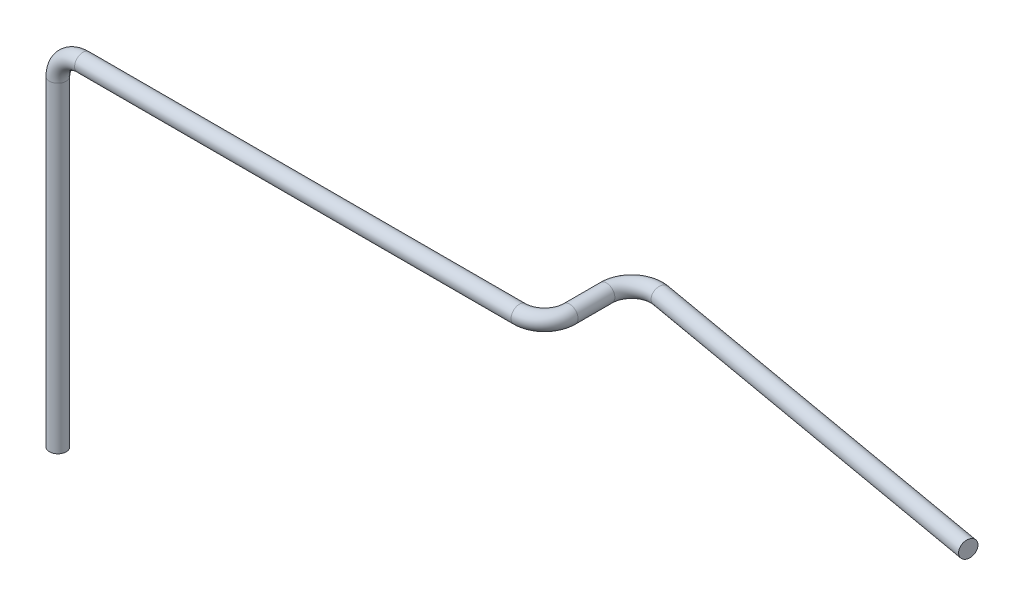
ISO-10303-21;
HEADER;
FILE_DESCRIPTION(('STEP AP214'),'2;1');
FILE_NAME('part.step','',(''),(''),'','','');
FILE_SCHEMA(('AUTOMOTIVE_DESIGN { 1 0 10303 214 1 1 1 1 }'));
ENDSEC;
DATA;
#1=APPLICATION_CONTEXT('core data for automotive mechanical design processes');
#2=APPLICATION_PROTOCOL_DEFINITION('international standard','automotive_design',2000,#1);
#3=PRODUCT_CONTEXT('',#1,'mechanical');
#4=PRODUCT('Part','Part','',(#3));
#5=PRODUCT_RELATED_PRODUCT_CATEGORY('part','',(#4));
#6=PRODUCT_DEFINITION_FORMATION('','',#4);
#7=PRODUCT_DEFINITION_CONTEXT('part definition',#1,'design');
#8=PRODUCT_DEFINITION('design','',#6,#7);
#9=PRODUCT_DEFINITION_SHAPE('','',#8);
#10=(LENGTH_UNIT() NAMED_UNIT(*) SI_UNIT(.MILLI.,.METRE.));
#11=(NAMED_UNIT(*) PLANE_ANGLE_UNIT() SI_UNIT($,.RADIAN.));
#12=(NAMED_UNIT(*) SI_UNIT($,.STERADIAN.) SOLID_ANGLE_UNIT());
#13=UNCERTAINTY_MEASURE_WITH_UNIT(LENGTH_MEASURE(1.E-05),#10,'distance_accuracy_value','');
#14=(GEOMETRIC_REPRESENTATION_CONTEXT(3) GLOBAL_UNCERTAINTY_ASSIGNED_CONTEXT((#13)) GLOBAL_UNIT_ASSIGNED_CONTEXT((#10,
#11,#12)) REPRESENTATION_CONTEXT('',''));
#15=CARTESIAN_POINT('',(0.,0.,0.));
#16=DIRECTION('',(0.,0.,1.));
#17=DIRECTION('',(1.,0.,0.));
#18=AXIS2_PLACEMENT_3D('',#15,#16,#17);
#19=CARTESIAN_POINT('',(8.75219586264241,1.778,-5.84945643708272));
#20=DIRECTION('',(0.984807753012208,0.,0.173648177666932));
#21=DIRECTION('',(0.173648177666932,0.,-0.984807753012208));
#22=AXIS2_PLACEMENT_3D('',#19,#20,#21);
#23=CYLINDRICAL_SURFACE('',#22,0.393699999999999);
#24=CARTESIAN_POINT('',(8.75219586264241,1.778,-5.84945643708272));
#25=DIRECTION('',(-0.984807753012208,0.,-0.173648177666933));
#26=DIRECTION('',(0.173648177666933,0.,-0.984807753012208));
#27=AXIS2_PLACEMENT_3D('',#24,#25,#26);
#28=CIRCLE('',#27,0.393699999999999);
#29=CARTESIAN_POINT('',(8.82056115018988,1.778,-6.23717524944362));
#30=VERTEX_POINT('',#29);
#31=EDGE_CURVE('E36',#30,#30,#28,.T.);
#32=ORIENTED_EDGE('',*,*,#31,.F.);
#33=EDGE_LOOP('',(#32));
#34=FACE_BOUND('',#33,.T.);
#35=CARTESIAN_POINT('',(26.289,1.778,-2.75724471226671));
#36=DIRECTION('',(-0.984807753012208,0.,-0.173648177666933));
#37=DIRECTION('',(0.173648177666933,0.,-0.984807753012208));
#38=AXIS2_PLACEMENT_3D('',#35,#36,#37);
#39=CIRCLE('',#38,0.393699999999999);
#40=CARTESIAN_POINT('',(26.3573652875475,1.778,-3.14496352462761));
#41=VERTEX_POINT('',#40);
#42=EDGE_CURVE('E10',#41,#41,#39,.T.);
#43=ORIENTED_EDGE('',*,*,#42,.T.);
#44=EDGE_LOOP('',(#43));
#45=FACE_BOUND('',#44,.T.);
#46=ADVANCED_FACE('F30',(#34,#45),#23,.T.);
#47=CARTESIAN_POINT('',(8.5471,1.778,-4.6863));
#48=DIRECTION('',(0.,-1.,0.));
#49=DIRECTION('',(0.,0.,-1.));
#50=AXIS2_PLACEMENT_3D('',#47,#48,#49);
#51=TOROIDAL_SURFACE('',#50,1.1811,0.393699999999999);
#52=CARTESIAN_POINT('',(7.366,1.778,-4.6863));
#53=DIRECTION('',(0.,0.,1.));
#54=DIRECTION('',(-1.,0.,0.));
#55=AXIS2_PLACEMENT_3D('',#52,#53,#54);
#56=CIRCLE('',#55,0.393699999999999);
#57=CARTESIAN_POINT('',(6.9723,1.778,-4.6863));
#58=VERTEX_POINT('',#57);
#59=EDGE_CURVE('E40',#58,#58,#56,.T.);
#60=CARTESIAN_POINT('',(8.5471,1.778,-4.6863));
#61=DIRECTION('',(0.,-1.,0.));
#62=DIRECTION('',(0.,0.,-1.));
#63=AXIS2_PLACEMENT_3D('',#60,#61,#62);
#64=CIRCLE('',#63,1.5748);
#65=EDGE_CURVE('',#58,#30,#64,.T.);
#66=ORIENTED_EDGE('',*,*,#59,.F.);
#67=ORIENTED_EDGE('',*,*,#31,.T.);
#68=ORIENTED_EDGE('',*,*,#65,.T.);
#69=ORIENTED_EDGE('',*,*,#65,.F.);
#70=EDGE_LOOP('',(#66,#68,#67,#69));
#71=FACE_BOUND('',#70,.T.);
#72=ADVANCED_FACE('F86',(#71),#51,.T.);
#73=CARTESIAN_POINT('',(7.366,1.778,-2.9591));
#74=DIRECTION('',(0.,0.,-1.));
#75=DIRECTION('',(0.,1.,0.));
#76=AXIS2_PLACEMENT_3D('',#73,#74,#75);
#77=CYLINDRICAL_SURFACE('',#76,0.393699999999999);
#78=CARTESIAN_POINT('',(7.366,1.778,-2.9591));
#79=DIRECTION('',(0.,0.,1.));
#80=DIRECTION('',(-1.,0.,0.));
#81=AXIS2_PLACEMENT_3D('',#78,#79,#80);
#82=CIRCLE('',#81,0.393699999999999);
#83=CARTESIAN_POINT('',(7.7597,1.778,-2.9591));
#84=VERTEX_POINT('',#83);
#85=EDGE_CURVE('E44',#84,#84,#82,.T.);
#86=ORIENTED_EDGE('',*,*,#85,.F.);
#87=EDGE_LOOP('',(#86));
#88=FACE_BOUND('',#87,.T.);
#89=ORIENTED_EDGE('',*,*,#59,.T.);
#90=EDGE_LOOP('',(#89));
#91=FACE_BOUND('',#90,.T.);
#92=ADVANCED_FACE('F80',(#88,#91),#77,.T.);
#93=CARTESIAN_POINT('',(6.1849,1.778,-2.9591));
#94=DIRECTION('',(0.,1.,0.));
#95=DIRECTION('',(0.,0.,1.));
#96=AXIS2_PLACEMENT_3D('',#93,#94,#95);
#97=TOROIDAL_SURFACE('',#96,1.1811,0.393699999999999);
#98=CARTESIAN_POINT('',(6.1849,1.778,-1.778));
#99=DIRECTION('',(-1.,0.,0.));
#100=DIRECTION('',(0.,0.,-1.));
#101=AXIS2_PLACEMENT_3D('',#98,#99,#100);
#102=CIRCLE('',#101,0.393699999999999);
#103=CARTESIAN_POINT('',(6.1849,1.778,-1.3843));
#104=VERTEX_POINT('',#103);
#105=EDGE_CURVE('E49',#104,#104,#102,.T.);
#106=CARTESIAN_POINT('',(6.1849,1.778,-2.9591));
#107=DIRECTION('',(0.,1.,0.));
#108=DIRECTION('',(0.,0.,1.));
#109=AXIS2_PLACEMENT_3D('',#106,#107,#108);
#110=CIRCLE('',#109,1.5748);
#111=EDGE_CURVE('',#104,#84,#110,.T.);
#112=ORIENTED_EDGE('',*,*,#105,.F.);
#113=ORIENTED_EDGE('',*,*,#85,.T.);
#114=ORIENTED_EDGE('',*,*,#111,.T.);
#115=ORIENTED_EDGE('',*,*,#111,.F.);
#116=EDGE_LOOP('',(#112,#114,#113,#115));
#117=FACE_BOUND('',#116,.T.);
#118=ADVANCED_FACE('F74',(#117),#97,.T.);
#119=CARTESIAN_POINT('',(-14.3129,1.778,-1.77799999999999));
#120=DIRECTION('',(1.,0.,0.));
#121=DIRECTION('',(0.,0.,-1.));
#122=AXIS2_PLACEMENT_3D('',#119,#120,#121);
#123=CYLINDRICAL_SURFACE('',#122,0.393699999999999);
#124=CARTESIAN_POINT('',(-14.3129,1.778,-1.77799999999999));
#125=DIRECTION('',(-1.,0.,0.));
#126=DIRECTION('',(0.,0.,-1.));
#127=AXIS2_PLACEMENT_3D('',#124,#125,#126);
#128=CIRCLE('',#127,0.393699999999999);
#129=CARTESIAN_POINT('',(-14.3129,2.1717,-1.77799999999999));
#130=VERTEX_POINT('',#129);
#131=EDGE_CURVE('E52',#130,#130,#128,.T.);
#132=ORIENTED_EDGE('',*,*,#131,.F.);
#133=EDGE_LOOP('',(#132));
#134=FACE_BOUND('',#133,.T.);
#135=ORIENTED_EDGE('',*,*,#105,.T.);
#136=EDGE_LOOP('',(#135));
#137=FACE_BOUND('',#136,.T.);
#138=ADVANCED_FACE('F68',(#134,#137),#123,.T.);
#139=CARTESIAN_POINT('',(-14.3129,0.596899999999999,-1.77799999999999));
#140=DIRECTION('',(0.,0.,-1.));
#141=DIRECTION('',(-1.,0.,0.));
#142=AXIS2_PLACEMENT_3D('',#139,#140,#141);
#143=TOROIDAL_SURFACE('',#142,1.1811,0.393699999999999);
#144=CARTESIAN_POINT('',(-15.494,0.596899999999999,-1.77799999999999));
#145=DIRECTION('',(0.,-1.,0.));
#146=DIRECTION('',(0.,0.,-1.));
#147=AXIS2_PLACEMENT_3D('',#144,#145,#146);
#148=CIRCLE('',#147,0.393699999999999);
#149=CARTESIAN_POINT('',(-15.8877,0.596899999999999,-1.77799999999999));
#150=VERTEX_POINT('',#149);
#151=EDGE_CURVE('E55',#150,#150,#148,.T.);
#152=CARTESIAN_POINT('',(-14.3129,0.596899999999999,-1.77799999999999));
#153=DIRECTION('',(0.,0.,-1.));
#154=DIRECTION('',(-1.,0.,0.));
#155=AXIS2_PLACEMENT_3D('',#152,#153,#154);
#156=CIRCLE('',#155,1.5748);
#157=EDGE_CURVE('',#150,#130,#156,.T.);
#158=ORIENTED_EDGE('',*,*,#151,.F.);
#159=ORIENTED_EDGE('',*,*,#131,.T.);
#160=ORIENTED_EDGE('',*,*,#157,.T.);
#161=ORIENTED_EDGE('',*,*,#157,.F.);
#162=EDGE_LOOP('',(#158,#160,#159,#161));
#163=FACE_BOUND('',#162,.T.);
#164=ADVANCED_FACE('F65',(#163),#143,.T.);
#165=CARTESIAN_POINT('',(-15.494,0.596899999999999,-1.77799999999999));
#166=DIRECTION('',(0.,-1.,0.));
#167=DIRECTION('',(0.,0.,-1.));
#168=AXIS2_PLACEMENT_3D('',#165,#166,#167);
#169=CYLINDRICAL_SURFACE('',#168,0.393699999999999);
#170=ORIENTED_EDGE('',*,*,#151,.T.);
#171=EDGE_LOOP('',(#170));
#172=FACE_BOUND('',#171,.T.);
#173=CARTESIAN_POINT('',(-15.494,-14.478,-1.778));
#174=DIRECTION('',(0.,-1.,0.));
#175=DIRECTION('',(0.,0.,-1.));
#176=AXIS2_PLACEMENT_3D('',#173,#174,#175);
#177=CIRCLE('',#176,0.393699999999999);
#178=CARTESIAN_POINT('',(-15.494,-14.478,-2.1717));
#179=VERTEX_POINT('',#178);
#180=EDGE_CURVE('E56',#179,#179,#177,.T.);
#181=ORIENTED_EDGE('',*,*,#180,.F.);
#182=EDGE_LOOP('',(#181));
#183=FACE_BOUND('',#182,.T.);
#184=ADVANCED_FACE('F62',(#172,#183),#169,.T.);
#185=CARTESIAN_POINT('',(26.289,1.778,-2.75724471226671));
#186=DIRECTION('',(-0.984807753012208,0.,-0.173648177666933));
#187=DIRECTION('',(0.173648177666933,0.,-0.984807753012208));
#188=AXIS2_PLACEMENT_3D('',#185,#186,#187);
#189=PLANE('',#188);
#190=ORIENTED_EDGE('',*,*,#42,.F.);
#191=EDGE_LOOP('',(#190));
#192=FACE_BOUND('',#191,.T.);
#193=ADVANCED_FACE('F98',(#192),#189,.F.);
#194=CARTESIAN_POINT('',(-15.494,-14.478,-1.778));
#195=DIRECTION('',(0.,-1.,0.));
#196=DIRECTION('',(0.,0.,-1.));
#197=AXIS2_PLACEMENT_3D('',#194,#195,#196);
#198=PLANE('',#197);
#199=ORIENTED_EDGE('',*,*,#180,.T.);
#200=EDGE_LOOP('',(#199));
#201=FACE_BOUND('',#200,.T.);
#202=ADVANCED_FACE('F99',(#201),#198,.T.);
#203=CLOSED_SHELL('',(#46,#72,#92,#118,#138,#164,#184,#193,#202));
#204=MANIFOLD_SOLID_BREP('B2',#203);
#205=ADVANCED_BREP_SHAPE_REPRESENTATION('',(#18,#204),#14);
#206=SHAPE_DEFINITION_REPRESENTATION(#9,#205);
ENDSEC;
END-ISO-10303-21;
